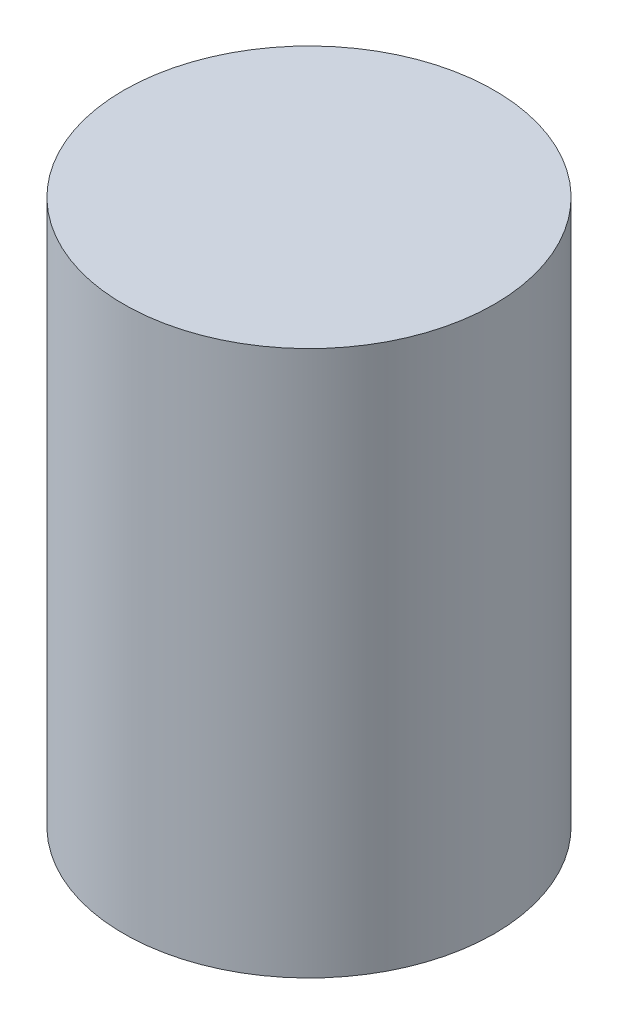
ISO-10303-21;
HEADER;
FILE_DESCRIPTION(('STEP AP214'),'2;1');
FILE_NAME('part.step','',(''),(''),'','','');
FILE_SCHEMA(('AUTOMOTIVE_DESIGN { 1 0 10303 214 1 1 1 1 }'));
ENDSEC;
DATA;
#1=APPLICATION_CONTEXT('core data for automotive mechanical design processes');
#2=APPLICATION_PROTOCOL_DEFINITION('international standard','automotive_design',2000,#1);
#3=PRODUCT_CONTEXT('',#1,'mechanical');
#4=PRODUCT('Part','Part','',(#3));
#5=PRODUCT_RELATED_PRODUCT_CATEGORY('part','',(#4));
#6=PRODUCT_DEFINITION_FORMATION('','',#4);
#7=PRODUCT_DEFINITION_CONTEXT('part definition',#1,'design');
#8=PRODUCT_DEFINITION('design','',#6,#7);
#9=PRODUCT_DEFINITION_SHAPE('','',#8);
#10=(LENGTH_UNIT() NAMED_UNIT(*) SI_UNIT(.MILLI.,.METRE.));
#11=(NAMED_UNIT(*) PLANE_ANGLE_UNIT() SI_UNIT($,.RADIAN.));
#12=(NAMED_UNIT(*) SI_UNIT($,.STERADIAN.) SOLID_ANGLE_UNIT());
#13=UNCERTAINTY_MEASURE_WITH_UNIT(LENGTH_MEASURE(1.E-05),#10,'distance_accuracy_value','');
#14=(GEOMETRIC_REPRESENTATION_CONTEXT(3) GLOBAL_UNCERTAINTY_ASSIGNED_CONTEXT((#13)) GLOBAL_UNIT_ASSIGNED_CONTEXT((#10,
#11,#12)) REPRESENTATION_CONTEXT('',''));
#15=CARTESIAN_POINT('',(0.,0.,0.));
#16=DIRECTION('',(0.,0.,1.));
#17=DIRECTION('',(1.,0.,0.));
#18=AXIS2_PLACEMENT_3D('',#15,#16,#17);
#19=CARTESIAN_POINT('',(0.,0.,0.));
#20=DIRECTION('',(0.,-1.,0.));
#21=DIRECTION('',(-1.,0.,0.));
#22=AXIS2_PLACEMENT_3D('',#19,#20,#21);
#23=SPHERICAL_SURFACE('',#22,12.5);
#24=CARTESIAN_POINT('',(0.,-10.,0.));
#25=DIRECTION('',(0.,-1.,0.));
#26=DIRECTION('',(1.,0.,0.));
#27=AXIS2_PLACEMENT_3D('',#24,#25,#26);
#28=CIRCLE('',#27,7.5);
#29=CARTESIAN_POINT('',(7.49999999999999,-10.,0.));
#30=VERTEX_POINT('',#29);
#31=EDGE_CURVE('E41',#30,#30,#28,.T.);
#32=ORIENTED_EDGE('',*,*,#31,.T.);
#33=EDGE_LOOP('',(#32));
#34=FACE_BOUND('',#33,.T.);
#35=ADVANCED_FACE('F31',(#34),#23,.F.);
#36=CARTESIAN_POINT('',(-17.,40.,0.));
#37=DIRECTION('',(0.,-1.,0.));
#38=DIRECTION('',(1.,0.,0.));
#39=AXIS2_PLACEMENT_3D('',#36,#37,#38);
#40=PLANE('',#39);
#41=CARTESIAN_POINT('',(0.,40.,0.));
#42=DIRECTION('',(0.,-1.,0.));
#43=DIRECTION('',(1.,0.,0.));
#44=AXIS2_PLACEMENT_3D('',#41,#42,#43);
#45=CIRCLE('',#44,17.);
#46=CARTESIAN_POINT('',(17.,40.,0.));
#47=VERTEX_POINT('',#46);
#48=EDGE_CURVE('E10',#47,#47,#45,.T.);
#49=ORIENTED_EDGE('',*,*,#48,.F.);
#50=EDGE_LOOP('',(#49));
#51=FACE_BOUND('',#50,.T.);
#52=ADVANCED_FACE('F56',(#51),#40,.F.);
#53=CARTESIAN_POINT('',(0.,0.,0.));
#54=DIRECTION('',(0.,-1.,0.));
#55=DIRECTION('',(1.,0.,0.));
#56=AXIS2_PLACEMENT_3D('',#53,#54,#55);
#57=CYLINDRICAL_SURFACE('',#56,17.);
#58=CARTESIAN_POINT('',(0.,-10.,0.));
#59=DIRECTION('',(0.,-1.,0.));
#60=DIRECTION('',(1.,0.,0.));
#61=AXIS2_PLACEMENT_3D('',#58,#59,#60);
#62=CIRCLE('',#61,17.);
#63=CARTESIAN_POINT('',(17.,-10.,0.));
#64=VERTEX_POINT('',#63);
#65=EDGE_CURVE('E37',#64,#64,#62,.T.);
#66=ORIENTED_EDGE('',*,*,#65,.F.);
#67=EDGE_LOOP('',(#66));
#68=FACE_BOUND('',#67,.T.);
#69=ORIENTED_EDGE('',*,*,#48,.T.);
#70=EDGE_LOOP('',(#69));
#71=FACE_BOUND('',#70,.T.);
#72=ADVANCED_FACE('F51',(#68,#71),#57,.T.);
#73=CARTESIAN_POINT('',(-7.5,-10.,0.));
#74=DIRECTION('',(0.,1.,0.));
#75=DIRECTION('',(-1.,0.,0.));
#76=AXIS2_PLACEMENT_3D('',#73,#74,#75);
#77=PLANE('',#76);
#78=ORIENTED_EDGE('',*,*,#31,.F.);
#79=EDGE_LOOP('',(#78));
#80=FACE_BOUND('',#79,.T.);
#81=ORIENTED_EDGE('',*,*,#65,.T.);
#82=EDGE_LOOP('',(#81));
#83=FACE_BOUND('',#82,.T.);
#84=ADVANCED_FACE('F49',(#80,#83),#77,.F.);
#85=CLOSED_SHELL('',(#35,#52,#72,#84));
#86=MANIFOLD_SOLID_BREP('B2',#85);
#87=ADVANCED_BREP_SHAPE_REPRESENTATION('',(#18,#86),#14);
#88=SHAPE_DEFINITION_REPRESENTATION(#9,#87);
ENDSEC;
END-ISO-10303-21;
